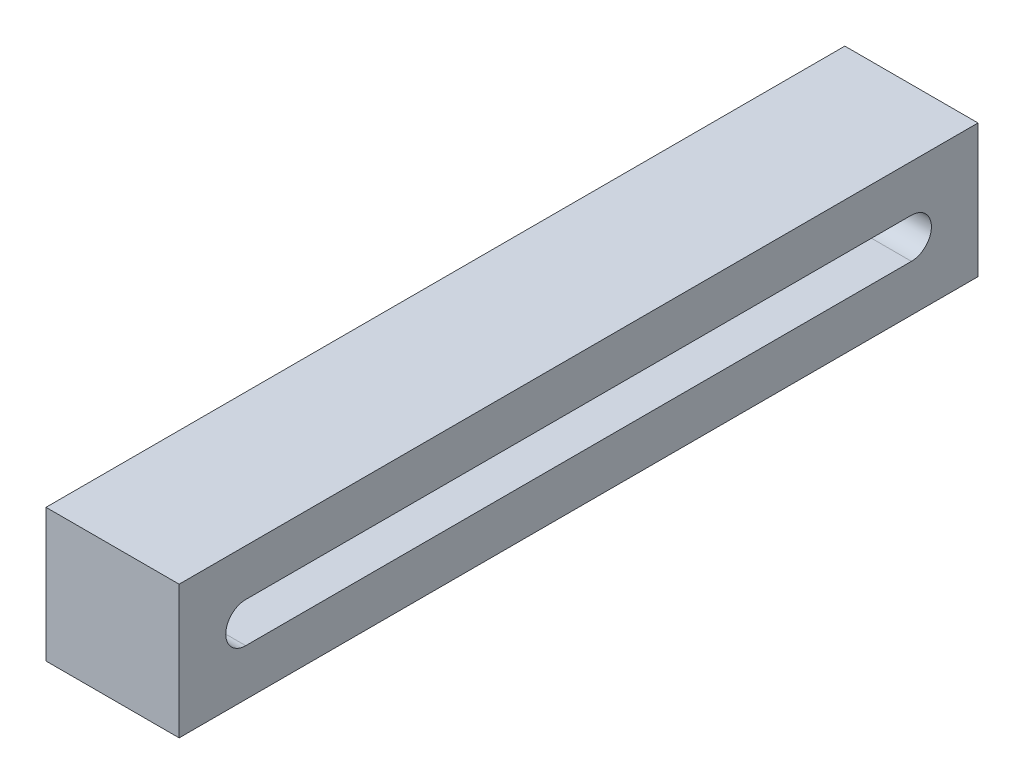
ISO-10303-21;
HEADER;
FILE_DESCRIPTION(('STEP AP214'),'2;1');
FILE_NAME('part.step','',(''),(''),'','','');
FILE_SCHEMA(('AUTOMOTIVE_DESIGN { 1 0 10303 214 1 1 1 1 }'));
ENDSEC;
DATA;
#1=APPLICATION_CONTEXT('core data for automotive mechanical design processes');
#2=APPLICATION_PROTOCOL_DEFINITION('international standard','automotive_design',2000,#1);
#3=PRODUCT_CONTEXT('',#1,'mechanical');
#4=PRODUCT('Part','Part','',(#3));
#5=PRODUCT_RELATED_PRODUCT_CATEGORY('part','',(#4));
#6=PRODUCT_DEFINITION_FORMATION('','',#4);
#7=PRODUCT_DEFINITION_CONTEXT('part definition',#1,'design');
#8=PRODUCT_DEFINITION('design','',#6,#7);
#9=PRODUCT_DEFINITION_SHAPE('','',#8);
#10=(LENGTH_UNIT() NAMED_UNIT(*) SI_UNIT(.MILLI.,.METRE.));
#11=(NAMED_UNIT(*) PLANE_ANGLE_UNIT() SI_UNIT($,.RADIAN.));
#12=(NAMED_UNIT(*) SI_UNIT($,.STERADIAN.) SOLID_ANGLE_UNIT());
#13=UNCERTAINTY_MEASURE_WITH_UNIT(LENGTH_MEASURE(1.E-05),#10,'distance_accuracy_value','');
#14=(GEOMETRIC_REPRESENTATION_CONTEXT(3) GLOBAL_UNCERTAINTY_ASSIGNED_CONTEXT((#13)) GLOBAL_UNIT_ASSIGNED_CONTEXT((#10,
#11,#12)) REPRESENTATION_CONTEXT('',''));
#15=CARTESIAN_POINT('',(0.,0.,0.));
#16=DIRECTION('',(0.,0.,1.));
#17=DIRECTION('',(1.,0.,0.));
#18=AXIS2_PLACEMENT_3D('',#15,#16,#17);
#19=CARTESIAN_POINT('',(10.,0.,0.));
#20=DIRECTION('',(1.,0.,0.));
#21=DIRECTION('',(0.,0.,-1.));
#22=AXIS2_PLACEMENT_3D('',#19,#20,#21);
#23=PLANE('',#22);
#24=DIRECTION('',(0.,-1.,0.));
#25=VECTOR('',#24,1.);
#26=CARTESIAN_POINT('',(10.,9.62195212296734,1.56603773584906));
#27=LINE('',#26,#25);
#28=CARTESIAN_POINT('',(10.,9.62195212296734,1.56603773584906));
#29=VERTEX_POINT('',#28);
#30=CARTESIAN_POINT('',(10.,-0.378047877032661,1.56603773584906));
#31=VERTEX_POINT('',#30);
#32=EDGE_CURVE('E137',#29,#31,#27,.T.);
#33=ORIENTED_EDGE('',*,*,#32,.T.);
#34=DIRECTION('',(0.,0.,-1.));
#35=VECTOR('',#34,1.);
#36=CARTESIAN_POINT('',(10.,-0.378047877032661,1.56603773584906));
#37=LINE('',#36,#35);
#38=CARTESIAN_POINT('',(10.,-0.378047877032661,-58.4339622641509));
#39=VERTEX_POINT('',#38);
#40=EDGE_CURVE('E140',#31,#39,#37,.T.);
#41=ORIENTED_EDGE('',*,*,#40,.T.);
#42=DIRECTION('',(0.,1.,0.));
#43=VECTOR('',#42,1.);
#44=CARTESIAN_POINT('',(10.,9.62195212296734,-58.4339622641509));
#45=LINE('',#44,#43);
#46=CARTESIAN_POINT('',(10.,9.62195212296734,-58.4339622641509));
#47=VERTEX_POINT('',#46);
#48=EDGE_CURVE('E143',#39,#47,#45,.T.);
#49=ORIENTED_EDGE('',*,*,#48,.T.);
#50=DIRECTION('',(0.,0.,1.));
#51=VECTOR('',#50,1.);
#52=CARTESIAN_POINT('',(10.,9.62195212296734,1.56603773584906));
#53=LINE('',#52,#51);
#54=EDGE_CURVE('E145',#47,#29,#53,.T.);
#55=ORIENTED_EDGE('',*,*,#54,.T.);
#56=EDGE_LOOP('',(#33,#41,#49,#55));
#57=FACE_BOUND('',#56,.T.);
#58=DIRECTION('',(0.,0.,-1.));
#59=VECTOR('',#58,1.);
#60=CARTESIAN_POINT('',(10.,3.12195212296734,-3.43396226415094));
#61=LINE('',#60,#59);
#62=CARTESIAN_POINT('',(10.,3.12195212296734,-3.43396226415094));
#63=VERTEX_POINT('',#62);
#64=CARTESIAN_POINT('',(10.,3.12195212296734,-53.4339622641509));
#65=VERTEX_POINT('',#64);
#66=EDGE_CURVE('E109',#63,#65,#61,.T.);
#67=ORIENTED_EDGE('',*,*,#66,.F.);
#68=CARTESIAN_POINT('',(10.,4.62195212296734,-3.43396226415094));
#69=DIRECTION('',(1.,0.,0.));
#70=DIRECTION('',(0.,0.,1.));
#71=AXIS2_PLACEMENT_3D('',#68,#69,#70);
#72=CIRCLE('',#71,1.5);
#73=CARTESIAN_POINT('',(10.,6.12195212296734,-3.43396226415094));
#74=VERTEX_POINT('',#73);
#75=EDGE_CURVE('E101',#74,#63,#72,.T.);
#76=ORIENTED_EDGE('',*,*,#75,.F.);
#77=DIRECTION('',(0.,0.,1.));
#78=VECTOR('',#77,1.);
#79=CARTESIAN_POINT('',(10.,6.12195212296734,-3.43396226415094));
#80=LINE('',#79,#78);
#81=CARTESIAN_POINT('',(10.,6.12195212296734,-53.4339622641509));
#82=VERTEX_POINT('',#81);
#83=EDGE_CURVE('E123',#82,#74,#80,.T.);
#84=ORIENTED_EDGE('',*,*,#83,.F.);
#85=CARTESIAN_POINT('',(10.,4.62195212296734,-53.4339622641509));
#86=DIRECTION('',(1.,0.,0.));
#87=DIRECTION('',(0.,0.,1.));
#88=AXIS2_PLACEMENT_3D('',#85,#86,#87);
#89=CIRCLE('',#88,1.5);
#90=EDGE_CURVE('E121',#65,#82,#89,.T.);
#91=ORIENTED_EDGE('',*,*,#90,.F.);
#92=EDGE_LOOP('',(#67,#76,#84,#91));
#93=FACE_BOUND('',#92,.T.);
#94=ADVANCED_FACE('F36',(#57,#93),#23,.T.);
#95=CARTESIAN_POINT('',(0.,0.,0.));
#96=DIRECTION('',(1.,0.,0.));
#97=DIRECTION('',(0.,0.,-1.));
#98=AXIS2_PLACEMENT_3D('',#95,#96,#97);
#99=PLANE('',#98);
#100=DIRECTION('',(0.,-1.,0.));
#101=VECTOR('',#100,1.);
#102=CARTESIAN_POINT('',(0.,9.62195212296734,1.56603773584906));
#103=LINE('',#102,#101);
#104=CARTESIAN_POINT('',(0.,9.62195212296734,1.56603773584906));
#105=VERTEX_POINT('',#104);
#106=CARTESIAN_POINT('',(0.,-0.378047877032661,1.56603773584906));
#107=VERTEX_POINT('',#106);
#108=EDGE_CURVE('E117',#105,#107,#103,.T.);
#109=ORIENTED_EDGE('',*,*,#108,.F.);
#110=DIRECTION('',(0.,0.,1.));
#111=VECTOR('',#110,1.);
#112=CARTESIAN_POINT('',(0.,9.62195212296734,1.56603773584906));
#113=LINE('',#112,#111);
#114=CARTESIAN_POINT('',(0.,9.62195212296734,-58.4339622641509));
#115=VERTEX_POINT('',#114);
#116=EDGE_CURVE('E141',#115,#105,#113,.T.);
#117=ORIENTED_EDGE('',*,*,#116,.F.);
#118=DIRECTION('',(0.,1.,0.));
#119=VECTOR('',#118,1.);
#120=CARTESIAN_POINT('',(0.,9.62195212296734,-58.4339622641509));
#121=LINE('',#120,#119);
#122=CARTESIAN_POINT('',(0.,-0.378047877032661,-58.4339622641509));
#123=VERTEX_POINT('',#122);
#124=EDGE_CURVE('E152',#123,#115,#121,.T.);
#125=ORIENTED_EDGE('',*,*,#124,.F.);
#126=DIRECTION('',(0.,0.,-1.));
#127=VECTOR('',#126,1.);
#128=CARTESIAN_POINT('',(0.,-0.378047877032661,1.56603773584906));
#129=LINE('',#128,#127);
#130=EDGE_CURVE('E150',#107,#123,#129,.T.);
#131=ORIENTED_EDGE('',*,*,#130,.F.);
#132=EDGE_LOOP('',(#109,#117,#125,#131));
#133=FACE_BOUND('',#132,.T.);
#134=CARTESIAN_POINT('',(0.,4.62195212296734,-3.43396226415094));
#135=DIRECTION('',(1.,0.,0.));
#136=DIRECTION('',(0.,0.,1.));
#137=AXIS2_PLACEMENT_3D('',#134,#135,#136);
#138=CIRCLE('',#137,1.5);
#139=CARTESIAN_POINT('',(0.,6.12195212296734,-3.43396226415094));
#140=VERTEX_POINT('',#139);
#141=CARTESIAN_POINT('',(0.,3.12195212296734,-3.43396226415094));
#142=VERTEX_POINT('',#141);
#143=EDGE_CURVE('E59',#140,#142,#138,.T.);
#144=ORIENTED_EDGE('',*,*,#143,.T.);
#145=DIRECTION('',(0.,0.,-1.));
#146=VECTOR('',#145,1.);
#147=CARTESIAN_POINT('',(0.,3.12195212296734,-3.43396226415094));
#148=LINE('',#147,#146);
#149=CARTESIAN_POINT('',(0.,3.12195212296734,-53.4339622641509));
#150=VERTEX_POINT('',#149);
#151=EDGE_CURVE('E116',#142,#150,#148,.T.);
#152=ORIENTED_EDGE('',*,*,#151,.T.);
#153=CARTESIAN_POINT('',(0.,4.62195212296734,-53.4339622641509));
#154=DIRECTION('',(1.,0.,0.));
#155=DIRECTION('',(0.,0.,1.));
#156=AXIS2_PLACEMENT_3D('',#153,#154,#155);
#157=CIRCLE('',#156,1.5);
#158=CARTESIAN_POINT('',(0.,6.12195212296734,-53.4339622641509));
#159=VERTEX_POINT('',#158);
#160=EDGE_CURVE('E129',#150,#159,#157,.T.);
#161=ORIENTED_EDGE('',*,*,#160,.T.);
#162=DIRECTION('',(0.,0.,1.));
#163=VECTOR('',#162,1.);
#164=CARTESIAN_POINT('',(0.,6.12195212296734,-3.43396226415094));
#165=LINE('',#164,#163);
#166=EDGE_CURVE('E110',#159,#140,#165,.T.);
#167=ORIENTED_EDGE('',*,*,#166,.T.);
#168=EDGE_LOOP('',(#144,#152,#161,#167));
#169=FACE_BOUND('',#168,.T.);
#170=ADVANCED_FACE('F170',(#133,#169),#99,.F.);
#171=CARTESIAN_POINT('',(10.,9.62195212296734,1.56603773584906));
#172=DIRECTION('',(0.,0.,-1.));
#173=DIRECTION('',(0.,1.,0.));
#174=AXIS2_PLACEMENT_3D('',#171,#172,#173);
#175=PLANE('',#174);
#176=ORIENTED_EDGE('',*,*,#108,.T.);
#177=DIRECTION('',(-1.,0.,0.));
#178=VECTOR('',#177,1.);
#179=CARTESIAN_POINT('',(10.,-0.378047877032661,1.56603773584906));
#180=LINE('',#179,#178);
#181=EDGE_CURVE('E11',#31,#107,#180,.T.);
#182=ORIENTED_EDGE('',*,*,#181,.F.);
#183=ORIENTED_EDGE('',*,*,#32,.F.);
#184=DIRECTION('',(-1.,0.,0.));
#185=VECTOR('',#184,1.);
#186=CARTESIAN_POINT('',(10.,9.62195212296734,1.56603773584906));
#187=LINE('',#186,#185);
#188=EDGE_CURVE('E147',#29,#105,#187,.T.);
#189=ORIENTED_EDGE('',*,*,#188,.T.);
#190=EDGE_LOOP('',(#176,#182,#183,#189));
#191=FACE_BOUND('',#190,.T.);
#192=ADVANCED_FACE('F38',(#191),#175,.F.);
#193=CARTESIAN_POINT('',(10.,-0.378047877032661,1.56603773584906));
#194=DIRECTION('',(0.,1.,0.));
#195=DIRECTION('',(0.,0.,1.));
#196=AXIS2_PLACEMENT_3D('',#193,#194,#195);
#197=PLANE('',#196);
#198=ORIENTED_EDGE('',*,*,#130,.T.);
#199=DIRECTION('',(-1.,0.,0.));
#200=VECTOR('',#199,1.);
#201=CARTESIAN_POINT('',(10.,-0.378047877032661,-58.4339622641509));
#202=LINE('',#201,#200);
#203=EDGE_CURVE('E44',#39,#123,#202,.T.);
#204=ORIENTED_EDGE('',*,*,#203,.F.);
#205=ORIENTED_EDGE('',*,*,#40,.F.);
#206=ORIENTED_EDGE('',*,*,#181,.T.);
#207=EDGE_LOOP('',(#198,#204,#205,#206));
#208=FACE_BOUND('',#207,.T.);
#209=ADVANCED_FACE('F180',(#208),#197,.F.);
#210=CARTESIAN_POINT('',(10.,9.62195212296734,-58.4339622641509));
#211=DIRECTION('',(0.,0.,1.));
#212=DIRECTION('',(1.,0.,0.));
#213=AXIS2_PLACEMENT_3D('',#210,#211,#212);
#214=PLANE('',#213);
#215=ORIENTED_EDGE('',*,*,#124,.T.);
#216=DIRECTION('',(-1.,0.,0.));
#217=VECTOR('',#216,1.);
#218=CARTESIAN_POINT('',(10.,9.62195212296734,-58.4339622641509));
#219=LINE('',#218,#217);
#220=EDGE_CURVE('E157',#47,#115,#219,.T.);
#221=ORIENTED_EDGE('',*,*,#220,.F.);
#222=ORIENTED_EDGE('',*,*,#48,.F.);
#223=ORIENTED_EDGE('',*,*,#203,.T.);
#224=EDGE_LOOP('',(#215,#221,#222,#223));
#225=FACE_BOUND('',#224,.T.);
#226=ADVANCED_FACE('F164',(#225),#214,.F.);
#227=CARTESIAN_POINT('',(10.,9.62195212296734,1.56603773584906));
#228=DIRECTION('',(0.,-1.,0.));
#229=DIRECTION('',(0.,0.,-1.));
#230=AXIS2_PLACEMENT_3D('',#227,#228,#229);
#231=PLANE('',#230);
#232=ORIENTED_EDGE('',*,*,#116,.T.);
#233=ORIENTED_EDGE('',*,*,#188,.F.);
#234=ORIENTED_EDGE('',*,*,#54,.F.);
#235=ORIENTED_EDGE('',*,*,#220,.T.);
#236=EDGE_LOOP('',(#232,#233,#234,#235));
#237=FACE_BOUND('',#236,.T.);
#238=ADVANCED_FACE('F174',(#237),#231,.F.);
#239=CARTESIAN_POINT('',(10.,4.62195212296734,-3.43396226415094));
#240=DIRECTION('',(-1.,0.,0.));
#241=DIRECTION('',(0.,0.,1.));
#242=AXIS2_PLACEMENT_3D('',#239,#240,#241);
#243=CYLINDRICAL_SURFACE('',#242,1.5);
#244=ORIENTED_EDGE('',*,*,#143,.F.);
#245=DIRECTION('',(-1.,0.,0.));
#246=VECTOR('',#245,1.);
#247=CARTESIAN_POINT('',(10.,6.12195212296734,-3.43396226415094));
#248=LINE('',#247,#246);
#249=EDGE_CURVE('E105',#74,#140,#248,.T.);
#250=ORIENTED_EDGE('',*,*,#249,.F.);
#251=ORIENTED_EDGE('',*,*,#75,.T.);
#252=DIRECTION('',(-1.,0.,0.));
#253=VECTOR('',#252,1.);
#254=CARTESIAN_POINT('',(10.,3.12195212296734,-3.43396226415094));
#255=LINE('',#254,#253);
#256=EDGE_CURVE('E104',#63,#142,#255,.T.);
#257=ORIENTED_EDGE('',*,*,#256,.T.);
#258=EDGE_LOOP('',(#244,#250,#251,#257));
#259=FACE_BOUND('',#258,.T.);
#260=ADVANCED_FACE('F103',(#259),#243,.F.);
#261=CARTESIAN_POINT('',(10.,3.12195212296734,-3.43396226415094));
#262=DIRECTION('',(0.,1.,0.));
#263=DIRECTION('',(0.,0.,1.));
#264=AXIS2_PLACEMENT_3D('',#261,#262,#263);
#265=PLANE('',#264);
#266=ORIENTED_EDGE('',*,*,#151,.F.);
#267=ORIENTED_EDGE('',*,*,#256,.F.);
#268=ORIENTED_EDGE('',*,*,#66,.T.);
#269=DIRECTION('',(-1.,0.,0.));
#270=VECTOR('',#269,1.);
#271=CARTESIAN_POINT('',(10.,3.12195212296734,-53.4339622641509));
#272=LINE('',#271,#270);
#273=EDGE_CURVE('E118',#65,#150,#272,.T.);
#274=ORIENTED_EDGE('',*,*,#273,.T.);
#275=EDGE_LOOP('',(#266,#267,#268,#274));
#276=FACE_BOUND('',#275,.T.);
#277=ADVANCED_FACE('F113',(#276),#265,.T.);
#278=CARTESIAN_POINT('',(10.,4.62195212296734,-53.4339622641509));
#279=DIRECTION('',(-1.,0.,0.));
#280=DIRECTION('',(0.,0.,1.));
#281=AXIS2_PLACEMENT_3D('',#278,#279,#280);
#282=CYLINDRICAL_SURFACE('',#281,1.5);
#283=ORIENTED_EDGE('',*,*,#160,.F.);
#284=ORIENTED_EDGE('',*,*,#273,.F.);
#285=ORIENTED_EDGE('',*,*,#90,.T.);
#286=DIRECTION('',(-1.,0.,0.));
#287=VECTOR('',#286,1.);
#288=CARTESIAN_POINT('',(10.,6.12195212296734,-53.4339622641509));
#289=LINE('',#288,#287);
#290=EDGE_CURVE('E51',#82,#159,#289,.T.);
#291=ORIENTED_EDGE('',*,*,#290,.T.);
#292=EDGE_LOOP('',(#283,#284,#285,#291));
#293=FACE_BOUND('',#292,.T.);
#294=ADVANCED_FACE('F203',(#293),#282,.F.);
#295=CARTESIAN_POINT('',(10.,6.12195212296734,-3.43396226415094));
#296=DIRECTION('',(0.,-1.,0.));
#297=DIRECTION('',(0.,0.,-1.));
#298=AXIS2_PLACEMENT_3D('',#295,#296,#297);
#299=PLANE('',#298);
#300=ORIENTED_EDGE('',*,*,#166,.F.);
#301=ORIENTED_EDGE('',*,*,#290,.F.);
#302=ORIENTED_EDGE('',*,*,#83,.T.);
#303=ORIENTED_EDGE('',*,*,#249,.T.);
#304=EDGE_LOOP('',(#300,#301,#302,#303));
#305=FACE_BOUND('',#304,.T.);
#306=ADVANCED_FACE('F207',(#305),#299,.T.);
#307=CLOSED_SHELL('',(#94,#170,#192,#209,#226,#238,#260,#277,#294,#306));
#308=MANIFOLD_SOLID_BREP('B2',#307);
#309=ADVANCED_BREP_SHAPE_REPRESENTATION('',(#18,#308),#14);
#310=SHAPE_DEFINITION_REPRESENTATION(#9,#309);
ENDSEC;
END-ISO-10303-21;
